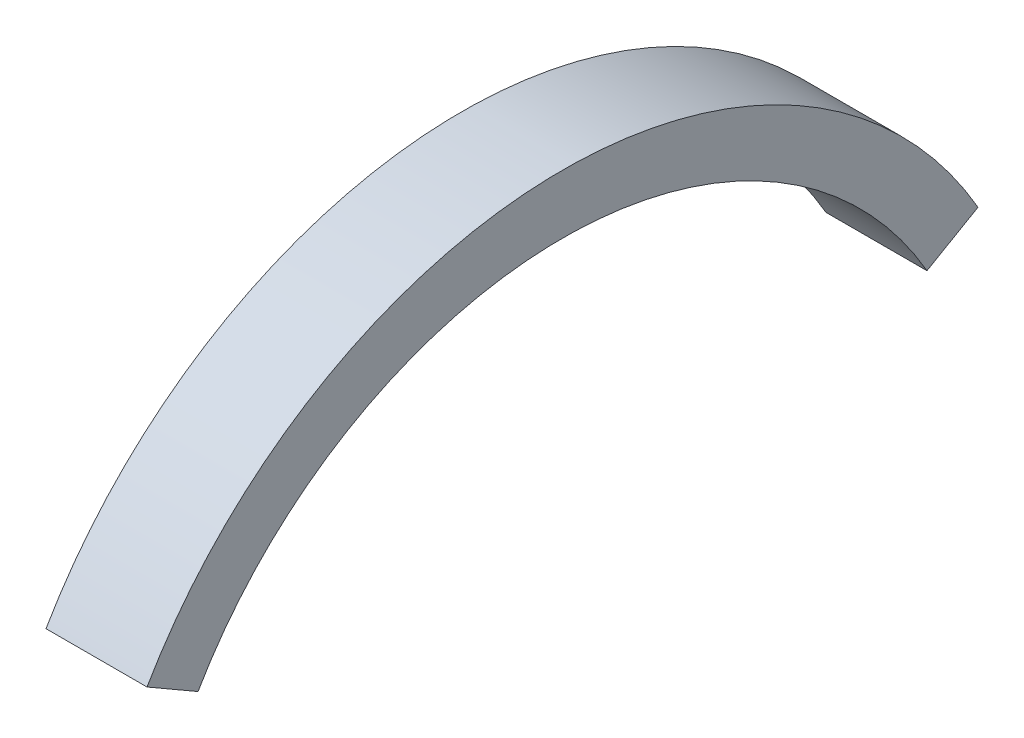
ISO-10303-21;
HEADER;
FILE_DESCRIPTION(('STEP AP214'),'2;1');
FILE_NAME('part.step','',(''),(''),'','','');
FILE_SCHEMA(('AUTOMOTIVE_DESIGN { 1 0 10303 214 1 1 1 1 }'));
ENDSEC;
DATA;
#1=APPLICATION_CONTEXT('core data for automotive mechanical design processes');
#2=APPLICATION_PROTOCOL_DEFINITION('international standard','automotive_design',2000,#1);
#3=PRODUCT_CONTEXT('',#1,'mechanical');
#4=PRODUCT('Part','Part','',(#3));
#5=PRODUCT_RELATED_PRODUCT_CATEGORY('part','',(#4));
#6=PRODUCT_DEFINITION_FORMATION('','',#4);
#7=PRODUCT_DEFINITION_CONTEXT('part definition',#1,'design');
#8=PRODUCT_DEFINITION('design','',#6,#7);
#9=PRODUCT_DEFINITION_SHAPE('','',#8);
#10=(LENGTH_UNIT() NAMED_UNIT(*) SI_UNIT(.MILLI.,.METRE.));
#11=(NAMED_UNIT(*) PLANE_ANGLE_UNIT() SI_UNIT($,.RADIAN.));
#12=(NAMED_UNIT(*) SI_UNIT($,.STERADIAN.) SOLID_ANGLE_UNIT());
#13=UNCERTAINTY_MEASURE_WITH_UNIT(LENGTH_MEASURE(1.E-05),#10,'distance_accuracy_value','');
#14=(GEOMETRIC_REPRESENTATION_CONTEXT(3) GLOBAL_UNCERTAINTY_ASSIGNED_CONTEXT((#13)) GLOBAL_UNIT_ASSIGNED_CONTEXT((#10,
#11,#12)) REPRESENTATION_CONTEXT('',''));
#15=CARTESIAN_POINT('',(0.,0.,0.));
#16=DIRECTION('',(0.,0.,1.));
#17=DIRECTION('',(1.,0.,0.));
#18=AXIS2_PLACEMENT_3D('',#15,#16,#17);
#19=CARTESIAN_POINT('',(3.,0.,0.));
#20=DIRECTION('',(-1.,0.,0.));
#21=DIRECTION('',(0.,0.,1.));
#22=AXIS2_PLACEMENT_3D('',#19,#20,#21);
#23=CYLINDRICAL_SURFACE('',#22,28.5);
#24=CARTESIAN_POINT('',(-3.,0.,0.));
#25=DIRECTION('',(1.,0.,0.));
#26=DIRECTION('',(0.,0.,-1.));
#27=AXIS2_PLACEMENT_3D('',#24,#25,#26);
#28=CIRCLE('',#27,28.5);
#29=CARTESIAN_POINT('',(-3.,14.25,-24.6817240078565));
#30=VERTEX_POINT('',#29);
#31=CARTESIAN_POINT('',(-3.,14.2499999999998,24.6817240078566));
#32=VERTEX_POINT('',#31);
#33=EDGE_CURVE('E99',#30,#32,#28,.T.);
#34=ORIENTED_EDGE('',*,*,#33,.T.);
#35=DIRECTION('',(-1.,0.,0.));
#36=VECTOR('',#35,1.);
#37=CARTESIAN_POINT('',(3.,14.2499999999998,24.6817240078566));
#38=LINE('',#37,#36);
#39=CARTESIAN_POINT('',(3.,14.2499999999998,24.6817240078566));
#40=VERTEX_POINT('',#39);
#41=EDGE_CURVE('E11',#40,#32,#38,.T.);
#42=ORIENTED_EDGE('',*,*,#41,.F.);
#43=CARTESIAN_POINT('',(3.,0.,0.));
#44=DIRECTION('',(1.,0.,0.));
#45=DIRECTION('',(0.,0.,-1.));
#46=AXIS2_PLACEMENT_3D('',#43,#44,#45);
#47=CIRCLE('',#46,28.5);
#48=CARTESIAN_POINT('',(3.,14.25,-24.6817240078565));
#49=VERTEX_POINT('',#48);
#50=EDGE_CURVE('E87',#49,#40,#47,.T.);
#51=ORIENTED_EDGE('',*,*,#50,.F.);
#52=DIRECTION('',(-1.,0.,0.));
#53=VECTOR('',#52,1.);
#54=CARTESIAN_POINT('',(3.,14.25,-24.6817240078565));
#55=LINE('',#54,#53);
#56=EDGE_CURVE('E95',#49,#30,#55,.T.);
#57=ORIENTED_EDGE('',*,*,#56,.T.);
#58=EDGE_LOOP('',(#34,#42,#51,#57));
#59=FACE_BOUND('',#58,.T.);
#60=ADVANCED_FACE('F36',(#59),#23,.T.);
#61=CARTESIAN_POINT('',(3.,14.2499999999998,24.6817240078566));
#62=DIRECTION('',(0.,0.866025403784441,-0.499999999999995));
#63=DIRECTION('',(0.,0.499999999999995,0.866025403784442));
#64=AXIS2_PLACEMENT_3D('',#61,#62,#63);
#65=PLANE('',#64);
#66=DIRECTION('',(0.,-0.499999999999995,-0.866025403784442));
#67=VECTOR('',#66,1.);
#68=CARTESIAN_POINT('',(-3.,14.2499999999998,24.6817240078566));
#69=LINE('',#68,#67);
#70=CARTESIAN_POINT('',(-3.,12.4999999999999,21.650635094611));
#71=VERTEX_POINT('',#70);
#72=EDGE_CURVE('E91',#32,#71,#69,.T.);
#73=ORIENTED_EDGE('',*,*,#72,.T.);
#74=DIRECTION('',(-1.,0.,0.));
#75=VECTOR('',#74,1.);
#76=CARTESIAN_POINT('',(3.,12.4999999999999,21.650635094611));
#77=LINE('',#76,#75);
#78=CARTESIAN_POINT('',(3.,12.4999999999999,21.650635094611));
#79=VERTEX_POINT('',#78);
#80=EDGE_CURVE('E44',#79,#71,#77,.T.);
#81=ORIENTED_EDGE('',*,*,#80,.F.);
#82=DIRECTION('',(0.,-0.499999999999995,-0.866025403784442));
#83=VECTOR('',#82,1.);
#84=CARTESIAN_POINT('',(3.,14.2499999999998,24.6817240078566));
#85=LINE('',#84,#83);
#86=EDGE_CURVE('E82',#40,#79,#85,.T.);
#87=ORIENTED_EDGE('',*,*,#86,.F.);
#88=ORIENTED_EDGE('',*,*,#41,.T.);
#89=EDGE_LOOP('',(#73,#81,#87,#88));
#90=FACE_BOUND('',#89,.T.);
#91=ADVANCED_FACE('F90',(#90),#65,.F.);
#92=CARTESIAN_POINT('',(3.,0.,0.));
#93=DIRECTION('',(-1.,0.,0.));
#94=DIRECTION('',(0.,0.,1.));
#95=AXIS2_PLACEMENT_3D('',#92,#93,#94);
#96=CYLINDRICAL_SURFACE('',#95,25.);
#97=CARTESIAN_POINT('',(-3.,0.,0.));
#98=DIRECTION('',(-1.,0.,0.));
#99=DIRECTION('',(0.,0.,-1.));
#100=AXIS2_PLACEMENT_3D('',#97,#98,#99);
#101=CIRCLE('',#100,25.);
#102=CARTESIAN_POINT('',(-3.,12.5,-21.650635094611));
#103=VERTEX_POINT('',#102);
#104=EDGE_CURVE('E69',#71,#103,#101,.T.);
#105=ORIENTED_EDGE('',*,*,#104,.T.);
#106=DIRECTION('',(-1.,0.,0.));
#107=VECTOR('',#106,1.);
#108=CARTESIAN_POINT('',(3.,12.5,-21.650635094611));
#109=LINE('',#108,#107);
#110=CARTESIAN_POINT('',(3.,12.5,-21.650635094611));
#111=VERTEX_POINT('',#110);
#112=EDGE_CURVE('E92',#111,#103,#109,.T.);
#113=ORIENTED_EDGE('',*,*,#112,.F.);
#114=CARTESIAN_POINT('',(3.,0.,0.));
#115=DIRECTION('',(-1.,0.,0.));
#116=DIRECTION('',(0.,0.,-1.));
#117=AXIS2_PLACEMENT_3D('',#114,#115,#116);
#118=CIRCLE('',#117,25.);
#119=EDGE_CURVE('E85',#79,#111,#118,.T.);
#120=ORIENTED_EDGE('',*,*,#119,.F.);
#121=ORIENTED_EDGE('',*,*,#80,.T.);
#122=EDGE_LOOP('',(#105,#113,#120,#121));
#123=FACE_BOUND('',#122,.T.);
#124=ADVANCED_FACE('F93',(#123),#96,.F.);
#125=CARTESIAN_POINT('',(3.,14.25,-24.6817240078565));
#126=DIRECTION('',(0.,0.866025403784438,0.500000000000001));
#127=DIRECTION('',(0.,-0.500000000000001,0.866025403784438));
#128=AXIS2_PLACEMENT_3D('',#125,#126,#127);
#129=PLANE('',#128);
#130=DIRECTION('',(0.,0.500000000000001,-0.866025403784438));
#131=VECTOR('',#130,1.);
#132=CARTESIAN_POINT('',(-3.,14.25,-24.6817240078565));
#133=LINE('',#132,#131);
#134=EDGE_CURVE('E75',#103,#30,#133,.T.);
#135=ORIENTED_EDGE('',*,*,#134,.T.);
#136=ORIENTED_EDGE('',*,*,#56,.F.);
#137=DIRECTION('',(0.,0.500000000000001,-0.866025403784438));
#138=VECTOR('',#137,1.);
#139=CARTESIAN_POINT('',(3.,14.25,-24.6817240078565));
#140=LINE('',#139,#138);
#141=EDGE_CURVE('E52',#111,#49,#140,.T.);
#142=ORIENTED_EDGE('',*,*,#141,.F.);
#143=ORIENTED_EDGE('',*,*,#112,.T.);
#144=EDGE_LOOP('',(#135,#136,#142,#143));
#145=FACE_BOUND('',#144,.T.);
#146=ADVANCED_FACE('F106',(#145),#129,.F.);
#147=CARTESIAN_POINT('',(3.,0.,0.));
#148=DIRECTION('',(1.,0.,0.));
#149=DIRECTION('',(0.,0.,-1.));
#150=AXIS2_PLACEMENT_3D('',#147,#148,#149);
#151=PLANE('',#150);
#152=ORIENTED_EDGE('',*,*,#50,.T.);
#153=ORIENTED_EDGE('',*,*,#86,.T.);
#154=ORIENTED_EDGE('',*,*,#119,.T.);
#155=ORIENTED_EDGE('',*,*,#141,.T.);
#156=EDGE_LOOP('',(#152,#153,#154,#155));
#157=FACE_BOUND('',#156,.T.);
#158=ADVANCED_FACE('F83',(#157),#151,.T.);
#159=CARTESIAN_POINT('',(-3.,0.,0.));
#160=DIRECTION('',(1.,0.,0.));
#161=DIRECTION('',(0.,0.,-1.));
#162=AXIS2_PLACEMENT_3D('',#159,#160,#161);
#163=PLANE('',#162);
#164=ORIENTED_EDGE('',*,*,#33,.F.);
#165=ORIENTED_EDGE('',*,*,#134,.F.);
#166=ORIENTED_EDGE('',*,*,#104,.F.);
#167=ORIENTED_EDGE('',*,*,#72,.F.);
#168=EDGE_LOOP('',(#164,#165,#166,#167));
#169=FACE_BOUND('',#168,.T.);
#170=ADVANCED_FACE('F109',(#169),#163,.F.);
#171=CLOSED_SHELL('',(#60,#91,#124,#146,#158,#170));
#172=MANIFOLD_SOLID_BREP('B2',#171);
#173=ADVANCED_BREP_SHAPE_REPRESENTATION('',(#18,#172),#14);
#174=SHAPE_DEFINITION_REPRESENTATION(#9,#173);
ENDSEC;
END-ISO-10303-21;
